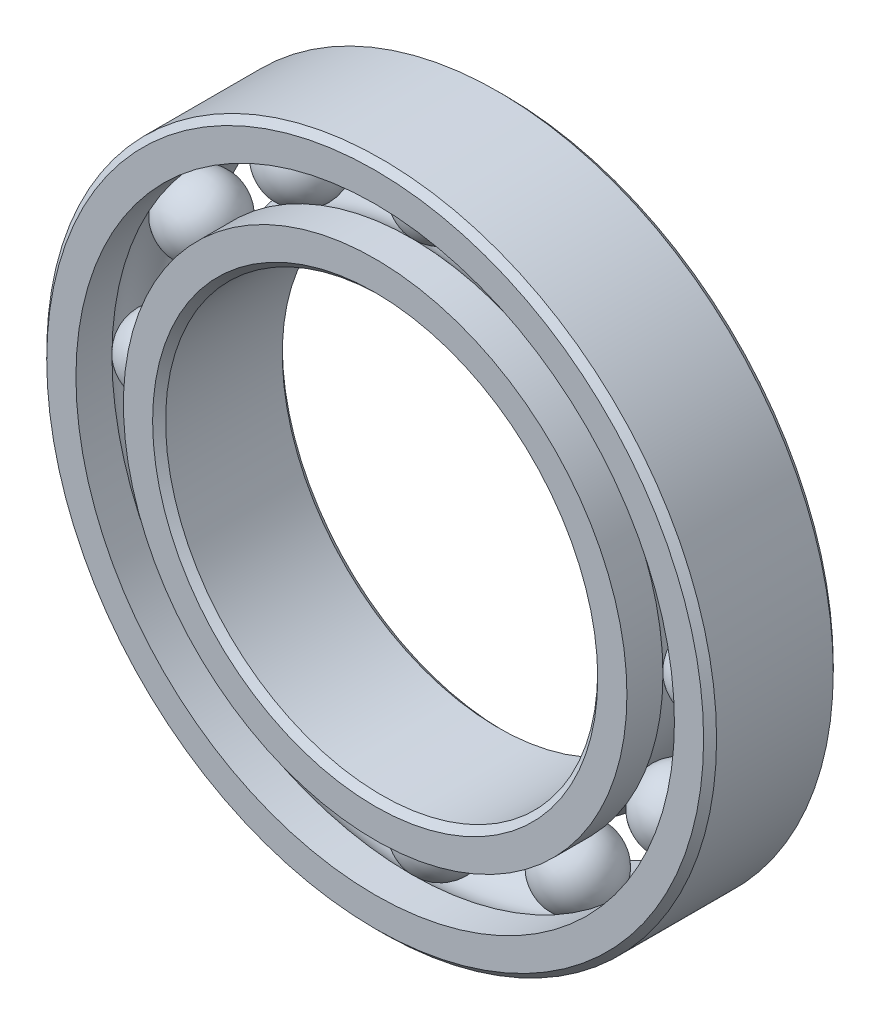
ISO-10303-21;
HEADER;
FILE_DESCRIPTION(('STEP AP214'),'2;1');
FILE_NAME('part.step','',(''),(''),'','','');
FILE_SCHEMA(('AUTOMOTIVE_DESIGN { 1 0 10303 214 1 1 1 1 }'));
ENDSEC;
DATA;
#1=APPLICATION_CONTEXT('core data for automotive mechanical design processes');
#2=APPLICATION_PROTOCOL_DEFINITION('international standard','automotive_design',2000,#1);
#3=PRODUCT_CONTEXT('',#1,'mechanical');
#4=PRODUCT('Part','Part','',(#3));
#5=PRODUCT_RELATED_PRODUCT_CATEGORY('part','',(#4));
#6=PRODUCT_DEFINITION_FORMATION('','',#4);
#7=PRODUCT_DEFINITION_CONTEXT('part definition',#1,'design');
#8=PRODUCT_DEFINITION('design','',#6,#7);
#9=PRODUCT_DEFINITION_SHAPE('','',#8);
#10=(LENGTH_UNIT() NAMED_UNIT(*) SI_UNIT(.MILLI.,.METRE.));
#11=(NAMED_UNIT(*) PLANE_ANGLE_UNIT() SI_UNIT($,.RADIAN.));
#12=(NAMED_UNIT(*) SI_UNIT($,.STERADIAN.) SOLID_ANGLE_UNIT());
#13=UNCERTAINTY_MEASURE_WITH_UNIT(LENGTH_MEASURE(1.E-05),#10,'distance_accuracy_value','');
#14=(GEOMETRIC_REPRESENTATION_CONTEXT(3) GLOBAL_UNCERTAINTY_ASSIGNED_CONTEXT((#13)) GLOBAL_UNIT_ASSIGNED_CONTEXT((#10,
#11,#12)) REPRESENTATION_CONTEXT('',''));
#15=CARTESIAN_POINT('',(0.,0.,0.));
#16=DIRECTION('',(0.,0.,1.));
#17=DIRECTION('',(1.,0.,0.));
#18=AXIS2_PLACEMENT_3D('',#15,#16,#17);
#19=CARTESIAN_POINT('',(-12.7498749999997,22.0834312901524,0.));
#20=DIRECTION('',(0.,0.,1.));
#21=DIRECTION('',(-0.499999999999989,0.866025403784445,0.));
#22=AXIS2_PLACEMENT_3D('',#19,#20,#21);
#23=SPHERICAL_SURFACE('',#22,3.45563968199453);
#24=CARTESIAN_POINT('',(-12.7498749999997,22.0834312901524,3.45563968199453));
#25=VERTEX_POINT('',#24);
#26=VERTEX_LOOP('',#25);
#27=FACE_BOUND('',#26,.T.);
#28=ADVANCED_FACE('F37',(#27),#23,.T.);
#29=CLOSED_SHELL('',(#28));
#30=MANIFOLD_SOLID_BREP('B2',#29);
#31=CARTESIAN_POINT('',(-22.0834312901521,12.7498750000003,0.));
#32=DIRECTION('',(0.,0.,1.));
#33=DIRECTION('',(-0.866025403784433,0.50000000000001,0.));
#34=AXIS2_PLACEMENT_3D('',#31,#32,#33);
#35=SPHERICAL_SURFACE('',#34,3.45563968199453);
#36=CARTESIAN_POINT('',(-22.0834312901521,12.7498750000003,3.45563968199453));
#37=VERTEX_POINT('',#36);
#38=VERTEX_LOOP('',#37);
#39=FACE_BOUND('',#38,.T.);
#40=ADVANCED_FACE('F57',(#39),#35,.T.);
#41=CLOSED_SHELL('',(#40));
#42=MANIFOLD_SOLID_BREP('B6',#41);
#43=CARTESIAN_POINT('',(-25.49975,2.67095703810496E-13,0.));
#44=DIRECTION('',(0.,0.,1.));
#45=DIRECTION('',(-1.,0.,0.));
#46=AXIS2_PLACEMENT_3D('',#43,#44,#45);
#47=SPHERICAL_SURFACE('',#46,3.45563968199453);
#48=CARTESIAN_POINT('',(-25.49975,2.67095703810496E-13,3.45563968199453));
#49=VERTEX_POINT('',#48);
#50=VERTEX_LOOP('',#49);
#51=FACE_BOUND('',#50,.T.);
#52=ADVANCED_FACE('F77',(#51),#47,.T.);
#53=CLOSED_SHELL('',(#52));
#54=MANIFOLD_SOLID_BREP('B33',#53);
#55=CARTESIAN_POINT('',(-22.0834312901524,-12.7498749999998,0.));
#56=DIRECTION('',(0.,0.,1.));
#57=DIRECTION('',(-0.866025403784443,-0.499999999999992,0.));
#58=AXIS2_PLACEMENT_3D('',#55,#56,#57);
#59=SPHERICAL_SURFACE('',#58,3.45563968199453);
#60=CARTESIAN_POINT('',(-22.0834312901524,-12.7498749999998,3.45563968199453));
#61=VERTEX_POINT('',#60);
#62=VERTEX_LOOP('',#61);
#63=FACE_BOUND('',#62,.T.);
#64=ADVANCED_FACE('F97',(#63),#59,.T.);
#65=CLOSED_SHELL('',(#64));
#66=MANIFOLD_SOLID_BREP('B53',#65);
#67=CARTESIAN_POINT('',(-12.7498750000002,-22.0834312901521,0.));
#68=DIRECTION('',(0.,0.,1.));
#69=DIRECTION('',(-0.500000000000007,-0.866025403784435,0.));
#70=AXIS2_PLACEMENT_3D('',#67,#68,#69);
#71=SPHERICAL_SURFACE('',#70,3.45563968199453);
#72=CARTESIAN_POINT('',(-12.7498750000002,-22.0834312901521,3.45563968199453));
#73=VERTEX_POINT('',#72);
#74=VERTEX_LOOP('',#73);
#75=FACE_BOUND('',#74,.T.);
#76=ADVANCED_FACE('F117',(#75),#71,.T.);
#77=CLOSED_SHELL('',(#76));
#78=MANIFOLD_SOLID_BREP('B73',#77);
#79=CARTESIAN_POINT('',(-1.7806380254033E-13,-25.49975,0.));
#80=DIRECTION('',(0.,0.,1.));
#81=DIRECTION('',(0.,-1.,0.));
#82=AXIS2_PLACEMENT_3D('',#79,#80,#81);
#83=SPHERICAL_SURFACE('',#82,3.45563968199453);
#84=CARTESIAN_POINT('',(-1.7806380254033E-13,-25.49975,3.45563968199453));
#85=VERTEX_POINT('',#84);
#86=VERTEX_LOOP('',#85);
#87=FACE_BOUND('',#86,.T.);
#88=ADVANCED_FACE('F137',(#87),#83,.T.);
#89=CLOSED_SHELL('',(#88));
#90=MANIFOLD_SOLID_BREP('B93',#89);
#91=CARTESIAN_POINT('',(12.7498749999999,-22.0834312901523,0.));
#92=DIRECTION('',(0.,0.,1.));
#93=DIRECTION('',(0.499999999999995,-0.866025403784442,0.));
#94=AXIS2_PLACEMENT_3D('',#91,#92,#93);
#95=SPHERICAL_SURFACE('',#94,3.45563968199453);
#96=CARTESIAN_POINT('',(12.7498749999999,-22.0834312901523,3.45563968199453));
#97=VERTEX_POINT('',#96);
#98=VERTEX_LOOP('',#97);
#99=FACE_BOUND('',#98,.T.);
#100=ADVANCED_FACE('F157',(#99),#95,.T.);
#101=CLOSED_SHELL('',(#100));
#102=MANIFOLD_SOLID_BREP('B113',#101);
#103=CARTESIAN_POINT('',(22.0834312901522,-12.7498750000001,0.));
#104=DIRECTION('',(0.,0.,1.));
#105=DIRECTION('',(0.866025403784436,-0.500000000000004,0.));
#106=AXIS2_PLACEMENT_3D('',#103,#104,#105);
#107=SPHERICAL_SURFACE('',#106,3.45563968199453);
#108=CARTESIAN_POINT('',(22.0834312901522,-12.7498750000001,3.45563968199453));
#109=VERTEX_POINT('',#108);
#110=VERTEX_LOOP('',#109);
#111=FACE_BOUND('',#110,.T.);
#112=ADVANCED_FACE('F177',(#111),#107,.T.);
#113=CLOSED_SHELL('',(#112));
#114=MANIFOLD_SOLID_BREP('B133',#113);
#115=CARTESIAN_POINT('',(25.49975,0.,0.));
#116=DIRECTION('',(0.,0.,1.));
#117=DIRECTION('',(1.,0.,0.));
#118=AXIS2_PLACEMENT_3D('',#115,#116,#117);
#119=SPHERICAL_SURFACE('',#118,3.45563968199453);
#120=CARTESIAN_POINT('',(25.49975,0.,3.45563968199453));
#121=VERTEX_POINT('',#120);
#122=VERTEX_LOOP('',#121);
#123=FACE_BOUND('',#122,.T.);
#124=ADVANCED_FACE('F197',(#123),#119,.T.);
#125=CLOSED_SHELL('',(#124));
#126=MANIFOLD_SOLID_BREP('B153',#125);
#127=CARTESIAN_POINT('',(22.0834312901523,12.7498749999999,0.));
#128=DIRECTION('',(0.,0.,1.));
#129=DIRECTION('',(0.86602540378444,0.499999999999998,0.));
#130=AXIS2_PLACEMENT_3D('',#127,#128,#129);
#131=SPHERICAL_SURFACE('',#130,3.45563968199453);
#132=CARTESIAN_POINT('',(22.0834312901523,12.7498749999999,3.45563968199453));
#133=VERTEX_POINT('',#132);
#134=VERTEX_LOOP('',#133);
#135=FACE_BOUND('',#134,.T.);
#136=ADVANCED_FACE('F217',(#135),#131,.T.);
#137=CLOSED_SHELL('',(#136));
#138=MANIFOLD_SOLID_BREP('B173',#137);
#139=CARTESIAN_POINT('',(12.749875,22.0834312901522,0.));
#140=DIRECTION('',(0.,0.,1.));
#141=DIRECTION('',(0.500000000000001,0.866025403784438,0.));
#142=AXIS2_PLACEMENT_3D('',#139,#140,#141);
#143=SPHERICAL_SURFACE('',#142,3.45563968199453);
#144=CARTESIAN_POINT('',(12.749875,22.0834312901522,3.45563968199453));
#145=VERTEX_POINT('',#144);
#146=VERTEX_LOOP('',#145);
#147=FACE_BOUND('',#146,.T.);
#148=ADVANCED_FACE('F237',(#147),#143,.T.);
#149=CLOSED_SHELL('',(#148));
#150=MANIFOLD_SOLID_BREP('B193',#149);
#151=CARTESIAN_POINT('',(0.,25.49975,0.));
#152=DIRECTION('',(0.,0.,1.));
#153=DIRECTION('',(0.,1.,0.));
#154=AXIS2_PLACEMENT_3D('',#151,#152,#153);
#155=SPHERICAL_SURFACE('',#154,3.45563968199453);
#156=CARTESIAN_POINT('',(0.,25.49975,3.45563968199453));
#157=VERTEX_POINT('',#156);
#158=VERTEX_LOOP('',#157);
#159=FACE_BOUND('',#158,.T.);
#160=ADVANCED_FACE('F259',(#159),#155,.T.);
#161=CLOSED_SHELL('',(#160));
#162=MANIFOLD_SOLID_BREP('B213',#161);
#163=CARTESIAN_POINT('',(0.,23.3019478021978,6.));
#164=DIRECTION('',(0.,0.,-1.));
#165=DIRECTION('',(-1.,0.,0.));
#166=AXIS2_PLACEMENT_3D('',#163,#164,#165);
#167=PLANE('',#166);
#168=CARTESIAN_POINT('',(0.,0.,6.));
#169=DIRECTION('',(0.,0.,1.));
#170=DIRECTION('',(1.,0.,0.));
#171=AXIS2_PLACEMENT_3D('',#168,#169,#170);
#172=CIRCLE('',#171,20.5995);
#173=CARTESIAN_POINT('',(20.5995,0.,6.));
#174=VERTEX_POINT('',#173);
#175=EDGE_CURVE('E306',#174,#174,#172,.T.);
#176=ORIENTED_EDGE('',*,*,#175,.F.);
#177=EDGE_LOOP('',(#176));
#178=FACE_BOUND('',#177,.T.);
#179=CARTESIAN_POINT('',(0.,0.,6.));
#180=DIRECTION('',(0.,0.,1.));
#181=DIRECTION('',(1.,0.,0.));
#182=AXIS2_PLACEMENT_3D('',#179,#180,#181);
#183=CIRCLE('',#182,23.3019478021978);
#184=CARTESIAN_POINT('',(23.3019478021978,0.,6.));
#185=VERTEX_POINT('',#184);
#186=EDGE_CURVE('E258',#185,#185,#183,.T.);
#187=ORIENTED_EDGE('',*,*,#186,.T.);
#188=EDGE_LOOP('',(#187));
#189=FACE_BOUND('',#188,.T.);
#190=ADVANCED_FACE('F278',(#178,#189),#167,.F.);
#191=CARTESIAN_POINT('',(0.,0.,6.));
#192=DIRECTION('',(0.,0.,1.));
#193=DIRECTION('',(1.,0.,0.));
#194=AXIS2_PLACEMENT_3D('',#191,#192,#193);
#195=CYLINDRICAL_SURFACE('',#194,23.3019478021978);
#196=ORIENTED_EDGE('',*,*,#186,.F.);
#197=EDGE_LOOP('',(#196));
#198=FACE_BOUND('',#197,.T.);
#199=CARTESIAN_POINT('',(0.,0.,2.66666666666667));
#200=DIRECTION('',(0.,0.,1.));
#201=DIRECTION('',(1.,0.,0.));
#202=AXIS2_PLACEMENT_3D('',#199,#200,#201);
#203=CIRCLE('',#202,23.3019478021978);
#204=CARTESIAN_POINT('',(23.3019478021978,0.,2.66666666666667));
#205=VERTEX_POINT('',#204);
#206=EDGE_CURVE('E284',#205,#205,#203,.T.);
#207=ORIENTED_EDGE('',*,*,#206,.T.);
#208=EDGE_LOOP('',(#207));
#209=FACE_BOUND('',#208,.T.);
#210=ADVANCED_FACE('F313',(#198,#209),#195,.T.);
#211=CARTESIAN_POINT('',(0.,0.,0.));
#212=DIRECTION('',(0.,0.,1.));
#213=DIRECTION('',(1.,0.,0.));
#214=AXIS2_PLACEMENT_3D('',#211,#212,#213);
#215=TOROIDAL_SURFACE('',#214,25.49975,3.45563968199453);
#216=ORIENTED_EDGE('',*,*,#206,.F.);
#217=EDGE_LOOP('',(#216));
#218=FACE_BOUND('',#217,.T.);
#219=CARTESIAN_POINT('',(0.,0.,-2.66666666666667));
#220=DIRECTION('',(0.,0.,1.));
#221=DIRECTION('',(1.,0.,0.));
#222=AXIS2_PLACEMENT_3D('',#219,#220,#221);
#223=CIRCLE('',#222,23.3019478021978);
#224=CARTESIAN_POINT('',(23.3019478021978,0.,-2.66666666666667));
#225=VERTEX_POINT('',#224);
#226=EDGE_CURVE('E288',#225,#225,#223,.T.);
#227=ORIENTED_EDGE('',*,*,#226,.T.);
#228=EDGE_LOOP('',(#227));
#229=FACE_BOUND('',#228,.T.);
#230=ADVANCED_FACE('F317',(#218,#229),#215,.F.);
#231=CARTESIAN_POINT('',(0.,0.,6.));
#232=DIRECTION('',(0.,0.,1.));
#233=DIRECTION('',(1.,0.,0.));
#234=AXIS2_PLACEMENT_3D('',#231,#232,#233);
#235=CYLINDRICAL_SURFACE('',#234,23.3019478021978);
#236=ORIENTED_EDGE('',*,*,#226,.F.);
#237=EDGE_LOOP('',(#236));
#238=FACE_BOUND('',#237,.T.);
#239=CARTESIAN_POINT('',(0.,0.,-6.));
#240=DIRECTION('',(0.,0.,1.));
#241=DIRECTION('',(1.,0.,0.));
#242=AXIS2_PLACEMENT_3D('',#239,#240,#241);
#243=CIRCLE('',#242,23.3019478021978);
#244=CARTESIAN_POINT('',(23.3019478021978,0.,-6.));
#245=VERTEX_POINT('',#244);
#246=EDGE_CURVE('E292',#245,#245,#243,.T.);
#247=ORIENTED_EDGE('',*,*,#246,.T.);
#248=EDGE_LOOP('',(#247));
#249=FACE_BOUND('',#248,.T.);
#250=ADVANCED_FACE('F322',(#238,#249),#235,.T.);
#251=CARTESIAN_POINT('',(0.,20.5995,-6.));
#252=DIRECTION('',(0.,0.,1.));
#253=DIRECTION('',(1.,0.,0.));
#254=AXIS2_PLACEMENT_3D('',#251,#252,#253);
#255=PLANE('',#254);
#256=ORIENTED_EDGE('',*,*,#246,.F.);
#257=EDGE_LOOP('',(#256));
#258=FACE_BOUND('',#257,.T.);
#259=CARTESIAN_POINT('',(0.,0.,-6.));
#260=DIRECTION('',(0.,0.,1.));
#261=DIRECTION('',(1.,0.,0.));
#262=AXIS2_PLACEMENT_3D('',#259,#260,#261);
#263=CIRCLE('',#262,20.5995);
#264=CARTESIAN_POINT('',(20.5995,0.,-6.));
#265=VERTEX_POINT('',#264);
#266=EDGE_CURVE('E297',#265,#265,#263,.T.);
#267=ORIENTED_EDGE('',*,*,#266,.T.);
#268=EDGE_LOOP('',(#267));
#269=FACE_BOUND('',#268,.T.);
#270=ADVANCED_FACE('F328',(#258,#269),#255,.F.);
#271=CARTESIAN_POINT('',(0.,0.,-5.4));
#272=DIRECTION('',(0.,0.,-1.));
#273=DIRECTION('',(-1.,0.,0.));
#274=AXIS2_PLACEMENT_3D('',#271,#272,#273);
#275=CONICAL_SURFACE('',#274,19.9995,0.785398163397448);
#276=ORIENTED_EDGE('',*,*,#266,.F.);
#277=EDGE_LOOP('',(#276));
#278=FACE_BOUND('',#277,.T.);
#279=CARTESIAN_POINT('',(0.,0.,-5.4));
#280=DIRECTION('',(0.,0.,1.));
#281=DIRECTION('',(1.,0.,0.));
#282=AXIS2_PLACEMENT_3D('',#279,#280,#281);
#283=CIRCLE('',#282,19.9995);
#284=CARTESIAN_POINT('',(19.9995,0.,-5.4));
#285=VERTEX_POINT('',#284);
#286=EDGE_CURVE('E300',#285,#285,#283,.T.);
#287=ORIENTED_EDGE('',*,*,#286,.T.);
#288=EDGE_LOOP('',(#287));
#289=FACE_BOUND('',#288,.T.);
#290=ADVANCED_FACE('F332',(#278,#289),#275,.F.);
#291=CARTESIAN_POINT('',(0.,0.,6.));
#292=DIRECTION('',(0.,0.,1.));
#293=DIRECTION('',(1.,0.,0.));
#294=AXIS2_PLACEMENT_3D('',#291,#292,#293);
#295=CYLINDRICAL_SURFACE('',#294,19.9995);
#296=ORIENTED_EDGE('',*,*,#286,.F.);
#297=EDGE_LOOP('',(#296));
#298=FACE_BOUND('',#297,.T.);
#299=CARTESIAN_POINT('',(0.,0.,5.4));
#300=DIRECTION('',(0.,0.,1.));
#301=DIRECTION('',(1.,0.,0.));
#302=AXIS2_PLACEMENT_3D('',#299,#300,#301);
#303=CIRCLE('',#302,19.9995);
#304=CARTESIAN_POINT('',(19.9995,0.,5.4));
#305=VERTEX_POINT('',#304);
#306=EDGE_CURVE('E303',#305,#305,#303,.T.);
#307=ORIENTED_EDGE('',*,*,#306,.T.);
#308=EDGE_LOOP('',(#307));
#309=FACE_BOUND('',#308,.T.);
#310=ADVANCED_FACE('F336',(#298,#309),#295,.F.);
#311=CARTESIAN_POINT('',(0.,0.,6.));
#312=DIRECTION('',(0.,0.,1.));
#313=DIRECTION('',(1.,0.,0.));
#314=AXIS2_PLACEMENT_3D('',#311,#312,#313);
#315=CONICAL_SURFACE('',#314,20.5995,0.785398163397448);
#316=ORIENTED_EDGE('',*,*,#306,.F.);
#317=EDGE_LOOP('',(#316));
#318=FACE_BOUND('',#317,.T.);
#319=ORIENTED_EDGE('',*,*,#175,.T.);
#320=EDGE_LOOP('',(#319));
#321=FACE_BOUND('',#320,.T.);
#322=ADVANCED_FACE('F310',(#318,#321),#315,.F.);
#323=CLOSED_SHELL('',(#190,#210,#230,#250,#270,#290,#310,#322));
#324=MANIFOLD_SOLID_BREP('B233',#323);
#325=CARTESIAN_POINT('',(0.,0.,5.4));
#326=DIRECTION('',(0.,0.,-1.));
#327=DIRECTION('',(-1.,0.,0.));
#328=AXIS2_PLACEMENT_3D('',#325,#326,#327);
#329=CONICAL_SURFACE('',#328,31.,0.785398163397448);
#330=CARTESIAN_POINT('',(0.,0.,6.));
#331=DIRECTION('',(0.,0.,1.));
#332=DIRECTION('',(1.,0.,0.));
#333=AXIS2_PLACEMENT_3D('',#330,#331,#332);
#334=CIRCLE('',#333,30.4);
#335=CARTESIAN_POINT('',(30.4,0.,6.));
#336=VERTEX_POINT('',#335);
#337=EDGE_CURVE('E427',#336,#336,#334,.T.);
#338=ORIENTED_EDGE('',*,*,#337,.F.);
#339=EDGE_LOOP('',(#338));
#340=FACE_BOUND('',#339,.T.);
#341=CARTESIAN_POINT('',(0.,0.,5.4));
#342=DIRECTION('',(0.,0.,1.));
#343=DIRECTION('',(1.,0.,0.));
#344=AXIS2_PLACEMENT_3D('',#341,#342,#343);
#345=CIRCLE('',#344,31.);
#346=CARTESIAN_POINT('',(31.,0.,5.4));
#347=VERTEX_POINT('',#346);
#348=EDGE_CURVE('E277',#347,#347,#345,.T.);
#349=ORIENTED_EDGE('',*,*,#348,.T.);
#350=EDGE_LOOP('',(#349));
#351=FACE_BOUND('',#350,.T.);
#352=ADVANCED_FACE('F399',(#340,#351),#329,.T.);
#353=CARTESIAN_POINT('',(0.,0.,6.));
#354=DIRECTION('',(0.,0.,1.));
#355=DIRECTION('',(1.,0.,0.));
#356=AXIS2_PLACEMENT_3D('',#353,#354,#355);
#357=CYLINDRICAL_SURFACE('',#356,31.);
#358=ORIENTED_EDGE('',*,*,#348,.F.);
#359=EDGE_LOOP('',(#358));
#360=FACE_BOUND('',#359,.T.);
#361=CARTESIAN_POINT('',(0.,0.,-5.4));
#362=DIRECTION('',(0.,0.,1.));
#363=DIRECTION('',(1.,0.,0.));
#364=AXIS2_PLACEMENT_3D('',#361,#362,#363);
#365=CIRCLE('',#364,31.);
#366=CARTESIAN_POINT('',(31.,0.,-5.4));
#367=VERTEX_POINT('',#366);
#368=EDGE_CURVE('E405',#367,#367,#365,.T.);
#369=ORIENTED_EDGE('',*,*,#368,.T.);
#370=EDGE_LOOP('',(#369));
#371=FACE_BOUND('',#370,.T.);
#372=ADVANCED_FACE('F434',(#360,#371),#357,.T.);
#373=CARTESIAN_POINT('',(0.,0.,-6.));
#374=DIRECTION('',(0.,0.,1.));
#375=DIRECTION('',(1.,0.,0.));
#376=AXIS2_PLACEMENT_3D('',#373,#374,#375);
#377=CONICAL_SURFACE('',#376,30.4,0.785398163397448);
#378=ORIENTED_EDGE('',*,*,#368,.F.);
#379=EDGE_LOOP('',(#378));
#380=FACE_BOUND('',#379,.T.);
#381=CARTESIAN_POINT('',(0.,0.,-6.));
#382=DIRECTION('',(0.,0.,1.));
#383=DIRECTION('',(1.,0.,0.));
#384=AXIS2_PLACEMENT_3D('',#381,#382,#383);
#385=CIRCLE('',#384,30.4);
#386=CARTESIAN_POINT('',(30.4,0.,-6.));
#387=VERTEX_POINT('',#386);
#388=EDGE_CURVE('E409',#387,#387,#385,.T.);
#389=ORIENTED_EDGE('',*,*,#388,.T.);
#390=EDGE_LOOP('',(#389));
#391=FACE_BOUND('',#390,.T.);
#392=ADVANCED_FACE('F438',(#380,#391),#377,.T.);
#393=CARTESIAN_POINT('',(0.,30.4,-6.));
#394=DIRECTION('',(0.,0.,1.));
#395=DIRECTION('',(1.,0.,0.));
#396=AXIS2_PLACEMENT_3D('',#393,#394,#395);
#397=PLANE('',#396);
#398=ORIENTED_EDGE('',*,*,#388,.F.);
#399=EDGE_LOOP('',(#398));
#400=FACE_BOUND('',#399,.T.);
#401=CARTESIAN_POINT('',(0.,0.,-6.));
#402=DIRECTION('',(0.,0.,1.));
#403=DIRECTION('',(1.,0.,0.));
#404=AXIS2_PLACEMENT_3D('',#401,#402,#403);
#405=CIRCLE('',#404,27.6975521978022);
#406=CARTESIAN_POINT('',(27.6975521978022,0.,-6.));
#407=VERTEX_POINT('',#406);
#408=EDGE_CURVE('E413',#407,#407,#405,.T.);
#409=ORIENTED_EDGE('',*,*,#408,.T.);
#410=EDGE_LOOP('',(#409));
#411=FACE_BOUND('',#410,.T.);
#412=ADVANCED_FACE('F443',(#400,#411),#397,.F.);
#413=CARTESIAN_POINT('',(0.,0.,6.));
#414=DIRECTION('',(0.,0.,1.));
#415=DIRECTION('',(1.,0.,0.));
#416=AXIS2_PLACEMENT_3D('',#413,#414,#415);
#417=CYLINDRICAL_SURFACE('',#416,27.6975521978022);
#418=ORIENTED_EDGE('',*,*,#408,.F.);
#419=EDGE_LOOP('',(#418));
#420=FACE_BOUND('',#419,.T.);
#421=CARTESIAN_POINT('',(0.,0.,-2.66666666666667));
#422=DIRECTION('',(0.,0.,1.));
#423=DIRECTION('',(1.,0.,0.));
#424=AXIS2_PLACEMENT_3D('',#421,#422,#423);
#425=CIRCLE('',#424,27.6975521978022);
#426=CARTESIAN_POINT('',(27.6975521978022,0.,-2.66666666666667));
#427=VERTEX_POINT('',#426);
#428=EDGE_CURVE('E418',#427,#427,#425,.T.);
#429=ORIENTED_EDGE('',*,*,#428,.T.);
#430=EDGE_LOOP('',(#429));
#431=FACE_BOUND('',#430,.T.);
#432=ADVANCED_FACE('F449',(#420,#431),#417,.F.);
#433=CARTESIAN_POINT('',(0.,0.,0.));
#434=DIRECTION('',(0.,0.,1.));
#435=DIRECTION('',(1.,0.,0.));
#436=AXIS2_PLACEMENT_3D('',#433,#434,#435);
#437=TOROIDAL_SURFACE('',#436,25.49975,3.45563968199453);
#438=ORIENTED_EDGE('',*,*,#428,.F.);
#439=EDGE_LOOP('',(#438));
#440=FACE_BOUND('',#439,.T.);
#441=CARTESIAN_POINT('',(0.,0.,2.66666666666667));
#442=DIRECTION('',(0.,0.,1.));
#443=DIRECTION('',(1.,0.,0.));
#444=AXIS2_PLACEMENT_3D('',#441,#442,#443);
#445=CIRCLE('',#444,27.6975521978022);
#446=CARTESIAN_POINT('',(27.6975521978022,0.,2.66666666666667));
#447=VERTEX_POINT('',#446);
#448=EDGE_CURVE('E421',#447,#447,#445,.T.);
#449=ORIENTED_EDGE('',*,*,#448,.T.);
#450=EDGE_LOOP('',(#449));
#451=FACE_BOUND('',#450,.T.);
#452=ADVANCED_FACE('F453',(#440,#451),#437,.F.);
#453=CARTESIAN_POINT('',(0.,0.,6.));
#454=DIRECTION('',(0.,0.,1.));
#455=DIRECTION('',(1.,0.,0.));
#456=AXIS2_PLACEMENT_3D('',#453,#454,#455);
#457=CYLINDRICAL_SURFACE('',#456,27.6975521978022);
#458=ORIENTED_EDGE('',*,*,#448,.F.);
#459=EDGE_LOOP('',(#458));
#460=FACE_BOUND('',#459,.T.);
#461=CARTESIAN_POINT('',(0.,0.,6.));
#462=DIRECTION('',(0.,0.,1.));
#463=DIRECTION('',(1.,0.,0.));
#464=AXIS2_PLACEMENT_3D('',#461,#462,#463);
#465=CIRCLE('',#464,27.6975521978022);
#466=CARTESIAN_POINT('',(27.6975521978022,0.,6.));
#467=VERTEX_POINT('',#466);
#468=EDGE_CURVE('E424',#467,#467,#465,.T.);
#469=ORIENTED_EDGE('',*,*,#468,.T.);
#470=EDGE_LOOP('',(#469));
#471=FACE_BOUND('',#470,.T.);
#472=ADVANCED_FACE('F457',(#460,#471),#457,.F.);
#473=CARTESIAN_POINT('',(0.,30.4,6.));
#474=DIRECTION('',(0.,0.,-1.));
#475=DIRECTION('',(-1.,0.,0.));
#476=AXIS2_PLACEMENT_3D('',#473,#474,#475);
#477=PLANE('',#476);
#478=ORIENTED_EDGE('',*,*,#468,.F.);
#479=EDGE_LOOP('',(#478));
#480=FACE_BOUND('',#479,.T.);
#481=ORIENTED_EDGE('',*,*,#337,.T.);
#482=EDGE_LOOP('',(#481));
#483=FACE_BOUND('',#482,.T.);
#484=ADVANCED_FACE('F431',(#480,#483),#477,.F.);
#485=CLOSED_SHELL('',(#352,#372,#392,#412,#432,#452,#472,#484));
#486=MANIFOLD_SOLID_BREP('B253',#485);
#487=ADVANCED_BREP_SHAPE_REPRESENTATION('',(#18,#30,#42,#54,#66,#78,#90,#102,#114,#126,#138,
#150,#162,#324,#486),#14);
#488=SHAPE_DEFINITION_REPRESENTATION(#9,#487);
ENDSEC;
END-ISO-10303-21;
